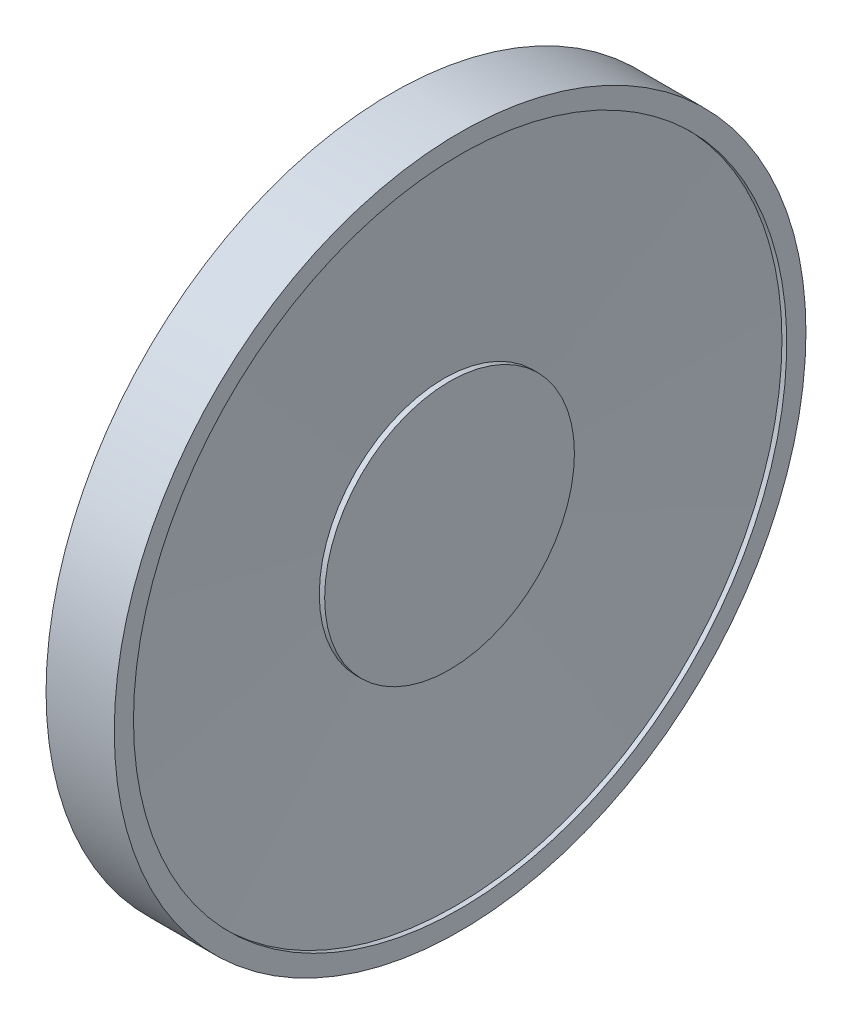
ISO-10303-21;
HEADER;
FILE_DESCRIPTION(('STEP AP214'),'2;1');
FILE_NAME('part.step','',(''),(''),'','','');
FILE_SCHEMA(('AUTOMOTIVE_DESIGN { 1 0 10303 214 1 1 1 1 }'));
ENDSEC;
DATA;
#1=APPLICATION_CONTEXT('core data for automotive mechanical design processes');
#2=APPLICATION_PROTOCOL_DEFINITION('international standard','automotive_design',2000,#1);
#3=PRODUCT_CONTEXT('',#1,'mechanical');
#4=PRODUCT('Part','Part','',(#3));
#5=PRODUCT_RELATED_PRODUCT_CATEGORY('part','',(#4));
#6=PRODUCT_DEFINITION_FORMATION('','',#4);
#7=PRODUCT_DEFINITION_CONTEXT('part definition',#1,'design');
#8=PRODUCT_DEFINITION('design','',#6,#7);
#9=PRODUCT_DEFINITION_SHAPE('','',#8);
#10=(LENGTH_UNIT() NAMED_UNIT(*) SI_UNIT(.MILLI.,.METRE.));
#11=(NAMED_UNIT(*) PLANE_ANGLE_UNIT() SI_UNIT($,.RADIAN.));
#12=(NAMED_UNIT(*) SI_UNIT($,.STERADIAN.) SOLID_ANGLE_UNIT());
#13=UNCERTAINTY_MEASURE_WITH_UNIT(LENGTH_MEASURE(1.E-05),#10,'distance_accuracy_value','');
#14=(GEOMETRIC_REPRESENTATION_CONTEXT(3) GLOBAL_UNCERTAINTY_ASSIGNED_CONTEXT((#13)) GLOBAL_UNIT_ASSIGNED_CONTEXT((#10,
#11,#12)) REPRESENTATION_CONTEXT('',''));
#15=CARTESIAN_POINT('',(0.,0.,0.));
#16=DIRECTION('',(0.,0.,1.));
#17=DIRECTION('',(1.,0.,0.));
#18=AXIS2_PLACEMENT_3D('',#15,#16,#17);
#19=CARTESIAN_POINT('',(3.5,0.,0.));
#20=DIRECTION('',(-1.,0.,0.));
#21=DIRECTION('',(0.,0.,1.));
#22=AXIS2_PLACEMENT_3D('',#19,#20,#21);
#23=CYLINDRICAL_SURFACE('',#22,8.75);
#24=CARTESIAN_POINT('',(0.,0.,0.));
#25=DIRECTION('',(1.,0.,0.));
#26=DIRECTION('',(0.,0.,-1.));
#27=AXIS2_PLACEMENT_3D('',#24,#25,#26);
#28=CIRCLE('',#27,8.75);
#29=CARTESIAN_POINT('',(0.,0.,-8.75));
#30=VERTEX_POINT('',#29);
#31=EDGE_CURVE('E127',#30,#30,#28,.T.);
#32=ORIENTED_EDGE('',*,*,#31,.T.);
#33=EDGE_LOOP('',(#32));
#34=FACE_BOUND('',#33,.T.);
#35=DIRECTION('',(1.,0.,0.));
#36=VECTOR('',#35,1.);
#37=CARTESIAN_POINT('',(0.1,-7.57772228311385,4.37499999999998));
#38=LINE('',#37,#36);
#39=CARTESIAN_POINT('',(0.0999999999999998,-7.57772228311385,4.37499999999998));
#40=VERTEX_POINT('',#39);
#41=CARTESIAN_POINT('',(0.5,-7.57772228311385,4.37499999999998));
#42=VERTEX_POINT('',#41);
#43=EDGE_CURVE('E84',#40,#42,#38,.T.);
#44=ORIENTED_EDGE('',*,*,#43,.T.);
#45=CARTESIAN_POINT('',(0.5,0.,0.));
#46=DIRECTION('',(-1.,0.,0.));
#47=DIRECTION('',(0.,0.,1.));
#48=AXIS2_PLACEMENT_3D('',#45,#46,#47);
#49=CIRCLE('',#48,8.75);
#50=CARTESIAN_POINT('',(0.5,-7.57772228311385,-4.37499999999998));
#51=VERTEX_POINT('',#50);
#52=EDGE_CURVE('E125',#42,#51,#49,.T.);
#53=ORIENTED_EDGE('',*,*,#52,.T.);
#54=DIRECTION('',(1.,0.,0.));
#55=VECTOR('',#54,1.);
#56=CARTESIAN_POINT('',(0.1,-7.57772228311385,-4.37499999999998));
#57=LINE('',#56,#55);
#58=CARTESIAN_POINT('',(0.0999999999999998,-7.57772228311385,-4.37499999999998));
#59=VERTEX_POINT('',#58);
#60=EDGE_CURVE('E58',#59,#51,#57,.T.);
#61=ORIENTED_EDGE('',*,*,#60,.F.);
#62=CARTESIAN_POINT('',(0.1,0.,0.));
#63=DIRECTION('',(1.,0.,0.));
#64=DIRECTION('',(0.,0.,1.));
#65=AXIS2_PLACEMENT_3D('',#62,#63,#64);
#66=CIRCLE('',#65,8.75);
#67=EDGE_CURVE('E53',#40,#59,#66,.T.);
#68=ORIENTED_EDGE('',*,*,#67,.F.);
#69=EDGE_LOOP('',(#44,#53,#61,#68));
#70=FACE_BOUND('',#69,.T.);
#71=ADVANCED_FACE('F37',(#34,#70),#23,.T.);
#72=CARTESIAN_POINT('',(0.5,0.,0.));
#73=DIRECTION('',(-1.,0.,0.));
#74=DIRECTION('',(0.,0.,1.));
#75=AXIS2_PLACEMENT_3D('',#72,#73,#74);
#76=PLANE('',#75);
#77=ORIENTED_EDGE('',*,*,#52,.F.);
#78=DIRECTION('',(0.,0.86602540378444,-0.499999999999998));
#79=VECTOR('',#78,1.);
#80=CARTESIAN_POINT('',(0.5,-14.2894191624433,8.24999999999996));
#81=LINE('',#80,#79);
#82=CARTESIAN_POINT('',(0.5,-14.2894191624433,8.24999999999996));
#83=VERTEX_POINT('',#82);
#84=EDGE_CURVE('E349',#83,#42,#81,.T.);
#85=ORIENTED_EDGE('',*,*,#84,.F.);
#86=CARTESIAN_POINT('',(0.5,0.,0.));
#87=DIRECTION('',(-1.,0.,0.));
#88=DIRECTION('',(0.,0.,1.));
#89=AXIS2_PLACEMENT_3D('',#86,#87,#88);
#90=CIRCLE('',#89,16.5);
#91=CARTESIAN_POINT('',(0.5,-14.2894191624433,-8.24999999999996));
#92=VERTEX_POINT('',#91);
#93=EDGE_CURVE('E99',#83,#92,#90,.T.);
#94=ORIENTED_EDGE('',*,*,#93,.T.);
#95=DIRECTION('',(0.,-0.86602540378444,-0.499999999999998));
#96=VECTOR('',#95,1.);
#97=CARTESIAN_POINT('',(0.5,-7.57772228311385,-4.37499999999998));
#98=LINE('',#97,#96);
#99=EDGE_CURVE('E95',#51,#92,#98,.T.);
#100=ORIENTED_EDGE('',*,*,#99,.F.);
#101=EDGE_LOOP('',(#77,#85,#94,#100));
#102=FACE_BOUND('',#101,.T.);
#103=ADVANCED_FACE('F158',(#102),#76,.T.);
#104=CARTESIAN_POINT('',(55.7116882454314,0.,0.));
#105=DIRECTION('',(-1.,0.,0.));
#106=DIRECTION('',(0.,0.,1.));
#107=AXIS2_PLACEMENT_3D('',#104,#105,#106);
#108=CYLINDRICAL_SURFACE('',#107,17.);
#109=CARTESIAN_POINT('',(4.8,0.,0.));
#110=DIRECTION('',(-1.,0.,0.));
#111=DIRECTION('',(0.,0.,1.));
#112=AXIS2_PLACEMENT_3D('',#109,#110,#111);
#113=CIRCLE('',#112,17.);
#114=CARTESIAN_POINT('',(4.8,0.,17.));
#115=VERTEX_POINT('',#114);
#116=EDGE_CURVE('E118',#115,#115,#113,.T.);
#117=ORIENTED_EDGE('',*,*,#116,.F.);
#118=EDGE_LOOP('',(#117));
#119=FACE_BOUND('',#118,.T.);
#120=CARTESIAN_POINT('',(4.55,0.,0.));
#121=DIRECTION('',(-1.,0.,0.));
#122=DIRECTION('',(0.,0.,1.));
#123=AXIS2_PLACEMENT_3D('',#120,#121,#122);
#124=CIRCLE('',#123,17.);
#125=CARTESIAN_POINT('',(4.55,0.,17.));
#126=VERTEX_POINT('',#125);
#127=EDGE_CURVE('E101',#126,#126,#124,.T.);
#128=ORIENTED_EDGE('',*,*,#127,.T.);
#129=EDGE_LOOP('',(#128));
#130=FACE_BOUND('',#129,.T.);
#131=ADVANCED_FACE('F148',(#119,#130),#108,.F.);
#132=CARTESIAN_POINT('',(55.7116882454314,0.,0.));
#133=DIRECTION('',(-1.,0.,0.));
#134=DIRECTION('',(0.,0.,1.));
#135=AXIS2_PLACEMENT_3D('',#132,#133,#134);
#136=CYLINDRICAL_SURFACE('',#135,18.);
#137=CARTESIAN_POINT('',(4.8,0.,0.));
#138=DIRECTION('',(-1.,0.,0.));
#139=DIRECTION('',(0.,0.,1.));
#140=AXIS2_PLACEMENT_3D('',#137,#138,#139);
#141=CIRCLE('',#140,18.);
#142=CARTESIAN_POINT('',(4.8,0.,18.));
#143=VERTEX_POINT('',#142);
#144=EDGE_CURVE('E114',#143,#143,#141,.T.);
#145=ORIENTED_EDGE('',*,*,#144,.T.);
#146=EDGE_LOOP('',(#145));
#147=FACE_BOUND('',#146,.T.);
#148=CARTESIAN_POINT('',(1.25,0.,0.));
#149=DIRECTION('',(1.,0.,0.));
#150=DIRECTION('',(0.,0.,-1.));
#151=AXIS2_PLACEMENT_3D('',#148,#149,#150);
#152=CIRCLE('',#151,18.);
#153=CARTESIAN_POINT('',(1.25,0.,-18.));
#154=VERTEX_POINT('',#153);
#155=EDGE_CURVE('E115',#154,#154,#152,.T.);
#156=ORIENTED_EDGE('',*,*,#155,.T.);
#157=EDGE_LOOP('',(#156));
#158=FACE_BOUND('',#157,.T.);
#159=ADVANCED_FACE('F145',(#147,#158),#136,.T.);
#160=CARTESIAN_POINT('',(4.8,0.,0.));
#161=DIRECTION('',(-1.,0.,0.));
#162=DIRECTION('',(0.,0.,1.));
#163=AXIS2_PLACEMENT_3D('',#160,#161,#162);
#164=PLANE('',#163);
#165=ORIENTED_EDGE('',*,*,#116,.T.);
#166=EDGE_LOOP('',(#165));
#167=FACE_BOUND('',#166,.T.);
#168=ORIENTED_EDGE('',*,*,#144,.F.);
#169=EDGE_LOOP('',(#168));
#170=FACE_BOUND('',#169,.T.);
#171=ADVANCED_FACE('F147',(#167,#170),#164,.F.);
#172=CARTESIAN_POINT('',(0.,0.,0.));
#173=DIRECTION('',(1.,0.,0.));
#174=DIRECTION('',(0.,0.,-1.));
#175=AXIS2_PLACEMENT_3D('',#172,#173,#174);
#176=PLANE('',#175);
#177=ORIENTED_EDGE('',*,*,#31,.F.);
#178=EDGE_LOOP('',(#177));
#179=FACE_BOUND('',#178,.T.);
#180=ADVANCED_FACE('F155',(#179),#176,.F.);
#181=CARTESIAN_POINT('',(2.,0.,0.));
#182=DIRECTION('',(-1.,0.,0.));
#183=DIRECTION('',(0.,0.,1.));
#184=AXIS2_PLACEMENT_3D('',#181,#182,#183);
#185=CYLINDRICAL_SURFACE('',#184,16.5);
#186=ORIENTED_EDGE('',*,*,#93,.F.);
#187=DIRECTION('',(1.,0.,0.));
#188=VECTOR('',#187,1.);
#189=CARTESIAN_POINT('',(0.1,-14.2894191624433,8.24999999999996));
#190=LINE('',#189,#188);
#191=CARTESIAN_POINT('',(0.1,-14.2894191624433,8.24999999999996));
#192=VERTEX_POINT('',#191);
#193=EDGE_CURVE('E83',#192,#83,#190,.T.);
#194=ORIENTED_EDGE('',*,*,#193,.F.);
#195=CARTESIAN_POINT('',(0.1,0.,0.));
#196=DIRECTION('',(-1.,0.,0.));
#197=DIRECTION('',(0.,0.,1.));
#198=AXIS2_PLACEMENT_3D('',#195,#196,#197);
#199=CIRCLE('',#198,16.5);
#200=CARTESIAN_POINT('',(0.1,-14.2894191624433,-8.24999999999996));
#201=VERTEX_POINT('',#200);
#202=EDGE_CURVE('E86',#201,#192,#199,.T.);
#203=ORIENTED_EDGE('',*,*,#202,.F.);
#204=DIRECTION('',(1.,0.,0.));
#205=VECTOR('',#204,1.);
#206=CARTESIAN_POINT('',(0.1,-14.2894191624433,-8.24999999999996));
#207=LINE('',#206,#205);
#208=EDGE_CURVE('E347',#201,#92,#207,.T.);
#209=ORIENTED_EDGE('',*,*,#208,.T.);
#210=EDGE_LOOP('',(#186,#194,#203,#209));
#211=FACE_BOUND('',#210,.T.);
#212=CARTESIAN_POINT('',(1.25,0.,0.));
#213=DIRECTION('',(1.,0.,0.));
#214=DIRECTION('',(0.,0.,-1.));
#215=AXIS2_PLACEMENT_3D('',#212,#213,#214);
#216=CIRCLE('',#215,16.5);
#217=CARTESIAN_POINT('',(1.25,0.,-16.5));
#218=VERTEX_POINT('',#217);
#219=EDGE_CURVE('E126',#218,#218,#216,.F.);
#220=ORIENTED_EDGE('',*,*,#219,.T.);
#221=EDGE_LOOP('',(#220));
#222=FACE_BOUND('',#221,.T.);
#223=ADVANCED_FACE('F97',(#211,#222),#185,.T.);
#224=CARTESIAN_POINT('',(1.25,0.,0.));
#225=DIRECTION('',(1.,0.,0.));
#226=DIRECTION('',(0.,0.,-1.));
#227=AXIS2_PLACEMENT_3D('',#224,#225,#226);
#228=PLANE('',#227);
#229=ORIENTED_EDGE('',*,*,#219,.F.);
#230=EDGE_LOOP('',(#229));
#231=FACE_BOUND('',#230,.T.);
#232=ORIENTED_EDGE('',*,*,#155,.F.);
#233=EDGE_LOOP('',(#232));
#234=FACE_BOUND('',#233,.T.);
#235=ADVANCED_FACE('F138',(#231,#234),#228,.F.);
#236=CARTESIAN_POINT('',(3.61118721113903,0.,0.));
#237=DIRECTION('',(1.,0.,0.));
#238=DIRECTION('',(0.,0.,-1.));
#239=AXIS2_PLACEMENT_3D('',#236,#237,#238);
#240=CONICAL_SURFACE('',#239,0.,1.51562808215029);
#241=ORIENTED_EDGE('',*,*,#127,.F.);
#242=EDGE_LOOP('',(#241));
#243=FACE_BOUND('',#242,.T.);
#244=CARTESIAN_POINT('',(3.97014504217411,0.,0.));
#245=DIRECTION('',(1.,0.,0.));
#246=DIRECTION('',(0.,0.,-1.));
#247=AXIS2_PLACEMENT_3D('',#244,#245,#246);
#248=CIRCLE('',#247,6.5);
#249=CARTESIAN_POINT('',(3.97014504217411,0.,-6.5));
#250=VERTEX_POINT('',#249);
#251=EDGE_CURVE('E40',#250,#250,#248,.F.);
#252=ORIENTED_EDGE('',*,*,#251,.T.);
#253=EDGE_LOOP('',(#252));
#254=FACE_BOUND('',#253,.T.);
#255=ADVANCED_FACE('F141',(#243,#254),#240,.F.);
#256=CARTESIAN_POINT('',(4.25,0.,0.));
#257=DIRECTION('',(1.,0.,0.));
#258=DIRECTION('',(0.,0.,-1.));
#259=AXIS2_PLACEMENT_3D('',#256,#257,#258);
#260=PLANE('',#259);
#261=CARTESIAN_POINT('',(4.25,0.,0.));
#262=DIRECTION('',(1.,0.,0.));
#263=DIRECTION('',(0.,0.,-1.));
#264=AXIS2_PLACEMENT_3D('',#261,#262,#263);
#265=CIRCLE('',#264,6.5);
#266=CARTESIAN_POINT('',(4.25,0.,-6.5));
#267=VERTEX_POINT('',#266);
#268=EDGE_CURVE('E111',#267,#267,#265,.T.);
#269=ORIENTED_EDGE('',*,*,#268,.T.);
#270=EDGE_LOOP('',(#269));
#271=FACE_BOUND('',#270,.T.);
#272=ADVANCED_FACE('F197',(#271),#260,.T.);
#273=CARTESIAN_POINT('',(4.25,0.,0.));
#274=DIRECTION('',(-1.,0.,0.));
#275=DIRECTION('',(0.,0.,1.));
#276=AXIS2_PLACEMENT_3D('',#273,#274,#275);
#277=CYLINDRICAL_SURFACE('',#276,6.5);
#278=ORIENTED_EDGE('',*,*,#268,.F.);
#279=EDGE_LOOP('',(#278));
#280=FACE_BOUND('',#279,.T.);
#281=ORIENTED_EDGE('',*,*,#251,.F.);
#282=EDGE_LOOP('',(#281));
#283=FACE_BOUND('',#282,.T.);
#284=ADVANCED_FACE('F199',(#280,#283),#277,.T.);
#285=CARTESIAN_POINT('',(0.1,-14.2894191624433,8.24999999999996));
#286=DIRECTION('',(0.,-0.499999999999998,-0.86602540378444));
#287=DIRECTION('',(0.,0.86602540378444,-0.499999999999998));
#288=AXIS2_PLACEMENT_3D('',#285,#286,#287);
#289=PLANE('',#288);
#290=ORIENTED_EDGE('',*,*,#84,.T.);
#291=ORIENTED_EDGE('',*,*,#43,.F.);
#292=DIRECTION('',(0.,0.86602540378444,-0.499999999999998));
#293=VECTOR('',#292,1.);
#294=CARTESIAN_POINT('',(0.1,-14.2894191624433,8.24999999999996));
#295=LINE('',#294,#293);
#296=EDGE_CURVE('E78',#192,#40,#295,.T.);
#297=ORIENTED_EDGE('',*,*,#296,.F.);
#298=ORIENTED_EDGE('',*,*,#193,.T.);
#299=EDGE_LOOP('',(#290,#291,#297,#298));
#300=FACE_BOUND('',#299,.T.);
#301=ADVANCED_FACE('F81',(#300),#289,.F.);
#302=CARTESIAN_POINT('',(0.1,-7.57772228311385,-4.37499999999998));
#303=DIRECTION('',(0.,-0.499999999999998,0.86602540378444));
#304=DIRECTION('',(0.,-0.86602540378444,-0.499999999999998));
#305=AXIS2_PLACEMENT_3D('',#302,#303,#304);
#306=PLANE('',#305);
#307=ORIENTED_EDGE('',*,*,#99,.T.);
#308=ORIENTED_EDGE('',*,*,#208,.F.);
#309=DIRECTION('',(0.,-0.86602540378444,-0.499999999999998));
#310=VECTOR('',#309,1.);
#311=CARTESIAN_POINT('',(0.1,-7.57772228311385,-4.37499999999998));
#312=LINE('',#311,#310);
#313=EDGE_CURVE('E91',#59,#201,#312,.T.);
#314=ORIENTED_EDGE('',*,*,#313,.F.);
#315=ORIENTED_EDGE('',*,*,#60,.T.);
#316=EDGE_LOOP('',(#307,#308,#314,#315));
#317=FACE_BOUND('',#316,.T.);
#318=ADVANCED_FACE('F206',(#317),#306,.F.);
#319=CARTESIAN_POINT('',(0.1,0.,0.));
#320=DIRECTION('',(-1.,0.,0.));
#321=DIRECTION('',(0.,0.,1.));
#322=AXIS2_PLACEMENT_3D('',#319,#320,#321);
#323=PLANE('',#322);
#324=ORIENTED_EDGE('',*,*,#202,.T.);
#325=ORIENTED_EDGE('',*,*,#296,.T.);
#326=ORIENTED_EDGE('',*,*,#67,.T.);
#327=ORIENTED_EDGE('',*,*,#313,.T.);
#328=EDGE_LOOP('',(#324,#325,#326,#327));
#329=FACE_BOUND('',#328,.T.);
#330=ADVANCED_FACE('F89',(#329),#323,.T.);
#331=CLOSED_SHELL('',(#71,#103,#131,#159,#171,#180,#223,#235,#255,#272,#284,#301,#318,#330));
#332=CARTESIAN_POINT('',(2.75000000000003,0.,0.));
#333=DIRECTION('',(1.,0.,0.));
#334=DIRECTION('',(0.,0.,-1.));
#335=AXIS2_PLACEMENT_3D('',#332,#333,#334);
#336=CONICAL_SURFACE('',#335,17.,1.48278895326715);
#337=CARTESIAN_POINT('',(2.57352941176473,0.,0.));
#338=DIRECTION('',(1.,0.,0.));
#339=DIRECTION('',(0.,0.,-1.));
#340=AXIS2_PLACEMENT_3D('',#337,#338,#339);
#341=CIRCLE('',#340,15.);
#342=CARTESIAN_POINT('',(2.57352941176473,0.,-15.));
#343=VERTEX_POINT('',#342);
#344=EDGE_CURVE('E104',#343,#343,#341,.T.);
#345=ORIENTED_EDGE('',*,*,#344,.F.);
#346=EDGE_LOOP('',(#345));
#347=FACE_BOUND('',#346,.T.);
#348=CARTESIAN_POINT('',(2.02205882352943,0.,0.));
#349=DIRECTION('',(1.,0.,0.));
#350=DIRECTION('',(0.,0.,-1.));
#351=AXIS2_PLACEMENT_3D('',#348,#349,#350);
#352=CIRCLE('',#351,8.75);
#353=CARTESIAN_POINT('',(2.02205882352943,0.,-8.75));
#354=VERTEX_POINT('',#353);
#355=EDGE_CURVE('E11',#354,#354,#352,.T.);
#356=ORIENTED_EDGE('',*,*,#355,.T.);
#357=EDGE_LOOP('',(#356));
#358=FACE_BOUND('',#357,.T.);
#359=ADVANCED_FACE('F182',(#347,#358),#336,.T.);
#360=CARTESIAN_POINT('',(2.75,0.,0.));
#361=DIRECTION('',(-1.,0.,0.));
#362=DIRECTION('',(0.,0.,1.));
#363=AXIS2_PLACEMENT_3D('',#360,#361,#362);
#364=CYLINDRICAL_SURFACE('',#363,15.);
#365=CARTESIAN_POINT('',(2.,0.,0.));
#366=DIRECTION('',(-1.,0.,0.));
#367=DIRECTION('',(0.,0.,1.));
#368=AXIS2_PLACEMENT_3D('',#365,#366,#367);
#369=CIRCLE('',#368,15.);
#370=CARTESIAN_POINT('',(2.,0.,15.));
#371=VERTEX_POINT('',#370);
#372=EDGE_CURVE('E123',#371,#371,#369,.F.);
#373=ORIENTED_EDGE('',*,*,#372,.F.);
#374=EDGE_LOOP('',(#373));
#375=FACE_BOUND('',#374,.T.);
#376=ORIENTED_EDGE('',*,*,#344,.T.);
#377=EDGE_LOOP('',(#376));
#378=FACE_BOUND('',#377,.T.);
#379=ADVANCED_FACE('F177',(#375,#378),#364,.F.);
#380=CARTESIAN_POINT('',(2.,0.,0.));
#381=DIRECTION('',(-1.,0.,0.));
#382=DIRECTION('',(0.,0.,1.));
#383=AXIS2_PLACEMENT_3D('',#380,#381,#382);
#384=PLANE('',#383);
#385=CARTESIAN_POINT('',(2.,0.,0.));
#386=DIRECTION('',(-1.,0.,0.));
#387=DIRECTION('',(0.,0.,1.));
#388=AXIS2_PLACEMENT_3D('',#385,#386,#387);
#389=CIRCLE('',#388,8.75);
#390=CARTESIAN_POINT('',(2.,0.,8.75));
#391=VERTEX_POINT('',#390);
#392=EDGE_CURVE('E130',#391,#391,#389,.T.);
#393=ORIENTED_EDGE('',*,*,#392,.T.);
#394=EDGE_LOOP('',(#393));
#395=FACE_BOUND('',#394,.T.);
#396=ORIENTED_EDGE('',*,*,#372,.T.);
#397=EDGE_LOOP('',(#396));
#398=FACE_BOUND('',#397,.T.);
#399=ADVANCED_FACE('F171',(#395,#398),#384,.F.);
#400=ORIENTED_EDGE('',*,*,#392,.F.);
#401=EDGE_LOOP('',(#400));
#402=FACE_BOUND('',#401,.T.);
#403=ORIENTED_EDGE('',*,*,#355,.F.);
#404=EDGE_LOOP('',(#403));
#405=FACE_BOUND('',#404,.T.);
#406=ADVANCED_FACE('F164',(#402,#405),#23,.T.);
#407=CLOSED_SHELL('',(#359,#379,#399,#406));
#408=ORIENTED_CLOSED_SHELL('',*,#407,.T.);
#409=BREP_WITH_VOIDS('B2',#331,(#408));
#410=ADVANCED_BREP_SHAPE_REPRESENTATION('',(#18,#409),#14);
#411=SHAPE_DEFINITION_REPRESENTATION(#9,#410);
ENDSEC;
END-ISO-10303-21;
